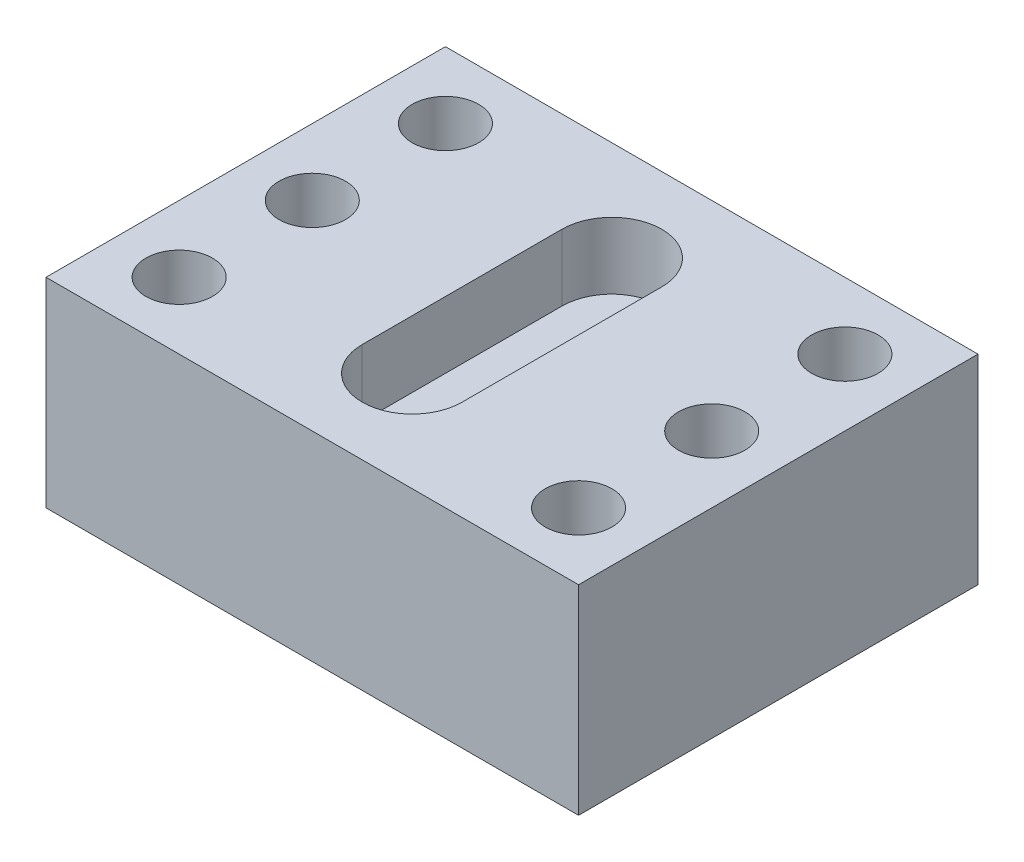
ISO-10303-21;
HEADER;
FILE_DESCRIPTION(('STEP AP214'),'2;1');
FILE_NAME('part.step','',(''),(''),'','','');
FILE_SCHEMA(('AUTOMOTIVE_DESIGN { 1 0 10303 214 1 1 1 1 }'));
ENDSEC;
DATA;
#1=APPLICATION_CONTEXT('core data for automotive mechanical design processes');
#2=APPLICATION_PROTOCOL_DEFINITION('international standard','automotive_design',2000,#1);
#3=PRODUCT_CONTEXT('',#1,'mechanical');
#4=PRODUCT('Part','Part','',(#3));
#5=PRODUCT_RELATED_PRODUCT_CATEGORY('part','',(#4));
#6=PRODUCT_DEFINITION_FORMATION('','',#4);
#7=PRODUCT_DEFINITION_CONTEXT('part definition',#1,'design');
#8=PRODUCT_DEFINITION('design','',#6,#7);
#9=PRODUCT_DEFINITION_SHAPE('','',#8);
#10=(LENGTH_UNIT() NAMED_UNIT(*) SI_UNIT(.MILLI.,.METRE.));
#11=(NAMED_UNIT(*) PLANE_ANGLE_UNIT() SI_UNIT($,.RADIAN.));
#12=(NAMED_UNIT(*) SI_UNIT($,.STERADIAN.) SOLID_ANGLE_UNIT());
#13=UNCERTAINTY_MEASURE_WITH_UNIT(LENGTH_MEASURE(1.E-05),#10,'distance_accuracy_value','');
#14=(GEOMETRIC_REPRESENTATION_CONTEXT(3) GLOBAL_UNCERTAINTY_ASSIGNED_CONTEXT((#13)) GLOBAL_UNIT_ASSIGNED_CONTEXT((#10,
#11,#12)) REPRESENTATION_CONTEXT('',''));
#15=CARTESIAN_POINT('',(0.,0.,0.));
#16=DIRECTION('',(0.,0.,1.));
#17=DIRECTION('',(1.,0.,0.));
#18=AXIS2_PLACEMENT_3D('',#15,#16,#17);
#19=CARTESIAN_POINT('',(101.6,76.2,76.2));
#20=DIRECTION('',(-1.,0.,0.));
#21=DIRECTION('',(0.,0.,1.));
#22=AXIS2_PLACEMENT_3D('',#19,#20,#21);
#23=PLANE('',#22);
#24=DIRECTION('',(0.,0.,-1.));
#25=VECTOR('',#24,1.);
#26=CARTESIAN_POINT('',(101.6,0.,76.2));
#27=LINE('',#26,#25);
#28=CARTESIAN_POINT('',(101.6,0.,76.2));
#29=VERTEX_POINT('',#28);
#30=CARTESIAN_POINT('',(101.6,0.,-76.2));
#31=VERTEX_POINT('',#30);
#32=EDGE_CURVE('E227',#29,#31,#27,.T.);
#33=ORIENTED_EDGE('',*,*,#32,.T.);
#34=DIRECTION('',(0.,-1.,0.));
#35=VECTOR('',#34,1.);
#36=CARTESIAN_POINT('',(101.6,76.2,-76.2));
#37=LINE('',#36,#35);
#38=CARTESIAN_POINT('',(101.6,76.2,-76.2));
#39=VERTEX_POINT('',#38);
#40=EDGE_CURVE('E12',#39,#31,#37,.T.);
#41=ORIENTED_EDGE('',*,*,#40,.F.);
#42=DIRECTION('',(0.,0.,-1.));
#43=VECTOR('',#42,1.);
#44=CARTESIAN_POINT('',(101.6,76.2,76.2));
#45=LINE('',#44,#43);
#46=CARTESIAN_POINT('',(101.6,76.2,76.2));
#47=VERTEX_POINT('',#46);
#48=EDGE_CURVE('E235',#47,#39,#45,.T.);
#49=ORIENTED_EDGE('',*,*,#48,.F.);
#50=DIRECTION('',(0.,-1.,0.));
#51=VECTOR('',#50,1.);
#52=CARTESIAN_POINT('',(101.6,76.2,76.2));
#53=LINE('',#52,#51);
#54=EDGE_CURVE('E255',#47,#29,#53,.T.);
#55=ORIENTED_EDGE('',*,*,#54,.T.);
#56=EDGE_LOOP('',(#33,#41,#49,#55));
#57=FACE_BOUND('',#56,.T.);
#58=ADVANCED_FACE('F48',(#57),#23,.F.);
#59=CARTESIAN_POINT('',(-101.6,76.2,-76.2));
#60=DIRECTION('',(0.,0.,1.));
#61=DIRECTION('',(1.,0.,0.));
#62=AXIS2_PLACEMENT_3D('',#59,#60,#61);
#63=PLANE('',#62);
#64=DIRECTION('',(-1.,0.,0.));
#65=VECTOR('',#64,1.);
#66=CARTESIAN_POINT('',(-101.6,0.,-76.2));
#67=LINE('',#66,#65);
#68=CARTESIAN_POINT('',(-101.6,0.,-76.2));
#69=VERTEX_POINT('',#68);
#70=EDGE_CURVE('E259',#31,#69,#67,.T.);
#71=ORIENTED_EDGE('',*,*,#70,.T.);
#72=DIRECTION('',(0.,-1.,0.));
#73=VECTOR('',#72,1.);
#74=CARTESIAN_POINT('',(-101.6,76.2,-76.2));
#75=LINE('',#74,#73);
#76=CARTESIAN_POINT('',(-101.6,76.2,-76.2));
#77=VERTEX_POINT('',#76);
#78=EDGE_CURVE('E56',#77,#69,#75,.T.);
#79=ORIENTED_EDGE('',*,*,#78,.F.);
#80=DIRECTION('',(-1.,0.,0.));
#81=VECTOR('',#80,1.);
#82=CARTESIAN_POINT('',(-101.6,76.2,-76.2));
#83=LINE('',#82,#81);
#84=EDGE_CURVE('E101',#39,#77,#83,.T.);
#85=ORIENTED_EDGE('',*,*,#84,.F.);
#86=ORIENTED_EDGE('',*,*,#40,.T.);
#87=EDGE_LOOP('',(#71,#79,#85,#86));
#88=FACE_BOUND('',#87,.T.);
#89=ADVANCED_FACE('F344',(#88),#63,.F.);
#90=CARTESIAN_POINT('',(-101.6,76.2,76.2));
#91=DIRECTION('',(1.,0.,0.));
#92=DIRECTION('',(0.,0.,-1.));
#93=AXIS2_PLACEMENT_3D('',#90,#91,#92);
#94=PLANE('',#93);
#95=DIRECTION('',(0.,0.,1.));
#96=VECTOR('',#95,1.);
#97=CARTESIAN_POINT('',(-101.6,0.,76.2));
#98=LINE('',#97,#96);
#99=CARTESIAN_POINT('',(-101.6,0.,76.2));
#100=VERTEX_POINT('',#99);
#101=EDGE_CURVE('E309',#69,#100,#98,.T.);
#102=ORIENTED_EDGE('',*,*,#101,.T.);
#103=DIRECTION('',(0.,-1.,0.));
#104=VECTOR('',#103,1.);
#105=CARTESIAN_POINT('',(-101.6,76.2,76.2));
#106=LINE('',#105,#104);
#107=CARTESIAN_POINT('',(-101.6,76.2,76.2));
#108=VERTEX_POINT('',#107);
#109=EDGE_CURVE('E318',#108,#100,#106,.T.);
#110=ORIENTED_EDGE('',*,*,#109,.F.);
#111=DIRECTION('',(0.,0.,1.));
#112=VECTOR('',#111,1.);
#113=CARTESIAN_POINT('',(-101.6,76.2,76.2));
#114=LINE('',#113,#112);
#115=EDGE_CURVE('E249',#77,#108,#114,.T.);
#116=ORIENTED_EDGE('',*,*,#115,.F.);
#117=ORIENTED_EDGE('',*,*,#78,.T.);
#118=EDGE_LOOP('',(#102,#110,#116,#117));
#119=FACE_BOUND('',#118,.T.);
#120=ADVANCED_FACE('F325',(#119),#94,.F.);
#121=CARTESIAN_POINT('',(-101.6,76.2,76.2));
#122=DIRECTION('',(0.,0.,-1.));
#123=DIRECTION('',(-1.,0.,0.));
#124=AXIS2_PLACEMENT_3D('',#121,#122,#123);
#125=PLANE('',#124);
#126=DIRECTION('',(1.,0.,0.));
#127=VECTOR('',#126,1.);
#128=CARTESIAN_POINT('',(-101.6,0.,76.2));
#129=LINE('',#128,#127);
#130=EDGE_CURVE('E94',#100,#29,#129,.T.);
#131=ORIENTED_EDGE('',*,*,#130,.T.);
#132=ORIENTED_EDGE('',*,*,#54,.F.);
#133=DIRECTION('',(1.,0.,0.));
#134=VECTOR('',#133,1.);
#135=CARTESIAN_POINT('',(-101.6,76.2,76.2));
#136=LINE('',#135,#134);
#137=EDGE_CURVE('E72',#108,#47,#136,.T.);
#138=ORIENTED_EDGE('',*,*,#137,.F.);
#139=ORIENTED_EDGE('',*,*,#109,.T.);
#140=EDGE_LOOP('',(#131,#132,#138,#139));
#141=FACE_BOUND('',#140,.T.);
#142=ADVANCED_FACE('F334',(#141),#125,.F.);
#143=CARTESIAN_POINT('',(0.,76.2,0.));
#144=DIRECTION('',(0.,-1.,0.));
#145=DIRECTION('',(0.,0.,-1.));
#146=AXIS2_PLACEMENT_3D('',#143,#144,#145);
#147=PLANE('',#146);
#148=CARTESIAN_POINT('',(-76.2,76.2,0.));
#149=DIRECTION('',(0.,1.,0.));
#150=DIRECTION('',(0.,0.,1.));
#151=AXIS2_PLACEMENT_3D('',#148,#149,#150);
#152=CIRCLE('',#151,12.7);
#153=CARTESIAN_POINT('',(-76.2,76.2,12.7));
#154=VERTEX_POINT('',#153);
#155=EDGE_CURVE('E210',#154,#154,#152,.T.);
#156=ORIENTED_EDGE('',*,*,#155,.F.);
#157=EDGE_LOOP('',(#156));
#158=FACE_BOUND('',#157,.T.);
#159=CARTESIAN_POINT('',(-76.2,76.2,-50.8));
#160=DIRECTION('',(0.,1.,0.));
#161=DIRECTION('',(0.,0.,1.));
#162=AXIS2_PLACEMENT_3D('',#159,#160,#161);
#163=CIRCLE('',#162,12.7);
#164=CARTESIAN_POINT('',(-76.2,76.2,-38.1));
#165=VERTEX_POINT('',#164);
#166=EDGE_CURVE('E620',#165,#165,#163,.T.);
#167=ORIENTED_EDGE('',*,*,#166,.F.);
#168=EDGE_LOOP('',(#167));
#169=FACE_BOUND('',#168,.T.);
#170=CARTESIAN_POINT('',(76.2,76.2,-50.8));
#171=DIRECTION('',(0.,1.,0.));
#172=DIRECTION('',(0.,0.,-1.));
#173=AXIS2_PLACEMENT_3D('',#170,#171,#172);
#174=CIRCLE('',#173,12.7);
#175=CARTESIAN_POINT('',(76.2,76.2,-63.5));
#176=VERTEX_POINT('',#175);
#177=EDGE_CURVE('E632',#176,#176,#174,.T.);
#178=ORIENTED_EDGE('',*,*,#177,.F.);
#179=EDGE_LOOP('',(#178));
#180=FACE_BOUND('',#179,.T.);
#181=CARTESIAN_POINT('',(76.2,76.2,50.7999999999999));
#182=DIRECTION('',(0.,1.,0.));
#183=DIRECTION('',(0.,0.,-1.));
#184=AXIS2_PLACEMENT_3D('',#181,#182,#183);
#185=CIRCLE('',#184,12.7);
#186=CARTESIAN_POINT('',(76.2,76.2,38.0999999999999));
#187=VERTEX_POINT('',#186);
#188=EDGE_CURVE('E228',#187,#187,#185,.T.);
#189=ORIENTED_EDGE('',*,*,#188,.F.);
#190=EDGE_LOOP('',(#189));
#191=FACE_BOUND('',#190,.T.);
#192=CARTESIAN_POINT('',(76.2,76.2,0.));
#193=DIRECTION('',(0.,1.,0.));
#194=DIRECTION('',(0.,0.,-1.));
#195=AXIS2_PLACEMENT_3D('',#192,#193,#194);
#196=CIRCLE('',#195,12.7);
#197=CARTESIAN_POINT('',(76.2,76.2,-12.7));
#198=VERTEX_POINT('',#197);
#199=EDGE_CURVE('E155',#198,#198,#196,.T.);
#200=ORIENTED_EDGE('',*,*,#199,.F.);
#201=EDGE_LOOP('',(#200));
#202=FACE_BOUND('',#201,.T.);
#203=DIRECTION('',(0.,0.,-1.));
#204=VECTOR('',#203,1.);
#205=CARTESIAN_POINT('',(19.05,76.2,38.1));
#206=LINE('',#205,#204);
#207=CARTESIAN_POINT('',(19.05,76.2,38.1));
#208=VERTEX_POINT('',#207);
#209=CARTESIAN_POINT('',(19.0500000000001,76.2,-38.1));
#210=VERTEX_POINT('',#209);
#211=EDGE_CURVE('E176',#208,#210,#206,.T.);
#212=ORIENTED_EDGE('',*,*,#211,.F.);
#213=CARTESIAN_POINT('',(0.,76.2,38.1));
#214=DIRECTION('',(0.,1.,0.));
#215=DIRECTION('',(0.,0.,1.));
#216=AXIS2_PLACEMENT_3D('',#213,#214,#215);
#217=CIRCLE('',#216,19.05);
#218=CARTESIAN_POINT('',(-19.05,76.2,38.1));
#219=VERTEX_POINT('',#218);
#220=EDGE_CURVE('E63',#219,#208,#217,.T.);
#221=ORIENTED_EDGE('',*,*,#220,.F.);
#222=DIRECTION('',(0.,0.,1.));
#223=VECTOR('',#222,1.);
#224=CARTESIAN_POINT('',(-19.05,76.2,38.1));
#225=LINE('',#224,#223);
#226=CARTESIAN_POINT('',(-19.05,76.2,-38.1));
#227=VERTEX_POINT('',#226);
#228=EDGE_CURVE('E147',#227,#219,#225,.T.);
#229=ORIENTED_EDGE('',*,*,#228,.F.);
#230=CARTESIAN_POINT('',(0.,76.2,-38.1));
#231=DIRECTION('',(0.,1.,0.));
#232=DIRECTION('',(0.,0.,-1.));
#233=AXIS2_PLACEMENT_3D('',#230,#231,#232);
#234=CIRCLE('',#233,19.05);
#235=EDGE_CURVE('E151',#210,#227,#234,.T.);
#236=ORIENTED_EDGE('',*,*,#235,.F.);
#237=EDGE_LOOP('',(#212,#221,#229,#236));
#238=FACE_BOUND('',#237,.T.);
#239=CARTESIAN_POINT('',(-76.2,76.2,50.8));
#240=DIRECTION('',(0.,1.,0.));
#241=DIRECTION('',(0.,0.,1.));
#242=AXIS2_PLACEMENT_3D('',#239,#240,#241);
#243=CIRCLE('',#242,12.7);
#244=CARTESIAN_POINT('',(-76.2,76.2,63.5));
#245=VERTEX_POINT('',#244);
#246=EDGE_CURVE('E209',#245,#245,#243,.T.);
#247=ORIENTED_EDGE('',*,*,#246,.F.);
#248=EDGE_LOOP('',(#247));
#249=FACE_BOUND('',#248,.T.);
#250=ORIENTED_EDGE('',*,*,#48,.T.);
#251=ORIENTED_EDGE('',*,*,#84,.T.);
#252=ORIENTED_EDGE('',*,*,#115,.T.);
#253=ORIENTED_EDGE('',*,*,#137,.T.);
#254=EDGE_LOOP('',(#250,#251,#252,#253));
#255=FACE_BOUND('',#254,.T.);
#256=ADVANCED_FACE('F336',(#158,#169,#180,#191,#202,#238,#249,#255),#147,.F.);
#257=CARTESIAN_POINT('',(0.,0.,0.));
#258=DIRECTION('',(0.,-1.,0.));
#259=DIRECTION('',(0.,0.,-1.));
#260=AXIS2_PLACEMENT_3D('',#257,#258,#259);
#261=PLANE('',#260);
#262=ORIENTED_EDGE('',*,*,#32,.F.);
#263=ORIENTED_EDGE('',*,*,#130,.F.);
#264=ORIENTED_EDGE('',*,*,#101,.F.);
#265=ORIENTED_EDGE('',*,*,#70,.F.);
#266=EDGE_LOOP('',(#262,#263,#264,#265));
#267=FACE_BOUND('',#266,.T.);
#268=ADVANCED_FACE('F330',(#267),#261,.T.);
#269=CARTESIAN_POINT('',(-76.2,50.8,50.8));
#270=DIRECTION('',(0.,1.,0.));
#271=DIRECTION('',(0.,0.,1.));
#272=AXIS2_PLACEMENT_3D('',#269,#270,#271);
#273=CYLINDRICAL_SURFACE('',#272,12.7);
#274=CARTESIAN_POINT('',(-76.2,50.8,50.8));
#275=DIRECTION('',(0.,1.,0.));
#276=DIRECTION('',(0.,0.,1.));
#277=AXIS2_PLACEMENT_3D('',#274,#275,#276);
#278=CIRCLE('',#277,12.7);
#279=CARTESIAN_POINT('',(-76.2,50.8,63.5));
#280=VERTEX_POINT('',#279);
#281=EDGE_CURVE('E222',#280,#280,#278,.T.);
#282=ORIENTED_EDGE('',*,*,#281,.F.);
#283=EDGE_LOOP('',(#282));
#284=FACE_BOUND('',#283,.T.);
#285=ORIENTED_EDGE('',*,*,#246,.T.);
#286=EDGE_LOOP('',(#285));
#287=FACE_BOUND('',#286,.T.);
#288=ADVANCED_FACE('F377',(#284,#287),#273,.F.);
#289=CARTESIAN_POINT('',(-76.2,50.8,50.8));
#290=DIRECTION('',(0.,1.,0.));
#291=DIRECTION('',(0.,0.,1.));
#292=AXIS2_PLACEMENT_3D('',#289,#290,#291);
#293=PLANE('',#292);
#294=ORIENTED_EDGE('',*,*,#281,.T.);
#295=EDGE_LOOP('',(#294));
#296=FACE_BOUND('',#295,.T.);
#297=ADVANCED_FACE('F384',(#296),#293,.T.);
#298=CARTESIAN_POINT('',(0.,50.8,38.1));
#299=DIRECTION('',(0.,1.,0.));
#300=DIRECTION('',(0.,0.,1.));
#301=AXIS2_PLACEMENT_3D('',#298,#299,#300);
#302=CYLINDRICAL_SURFACE('',#301,19.05);
#303=ORIENTED_EDGE('',*,*,#220,.T.);
#304=DIRECTION('',(0.,1.,0.));
#305=VECTOR('',#304,1.);
#306=CARTESIAN_POINT('',(19.05,50.8,38.1));
#307=LINE('',#306,#305);
#308=CARTESIAN_POINT('',(19.05,50.8,38.1));
#309=VERTEX_POINT('',#308);
#310=EDGE_CURVE('E121',#309,#208,#307,.T.);
#311=ORIENTED_EDGE('',*,*,#310,.F.);
#312=CARTESIAN_POINT('',(0.,50.8,38.1));
#313=DIRECTION('',(0.,1.,0.));
#314=DIRECTION('',(0.,0.,1.));
#315=AXIS2_PLACEMENT_3D('',#312,#313,#314);
#316=CIRCLE('',#315,19.05);
#317=CARTESIAN_POINT('',(-19.05,50.8,38.1));
#318=VERTEX_POINT('',#317);
#319=EDGE_CURVE('E125',#318,#309,#316,.T.);
#320=ORIENTED_EDGE('',*,*,#319,.F.);
#321=DIRECTION('',(0.,1.,0.));
#322=VECTOR('',#321,1.);
#323=CARTESIAN_POINT('',(-19.05,50.8,38.1));
#324=LINE('',#323,#322);
#325=EDGE_CURVE('E189',#318,#219,#324,.T.);
#326=ORIENTED_EDGE('',*,*,#325,.T.);
#327=EDGE_LOOP('',(#303,#311,#320,#326));
#328=FACE_BOUND('',#327,.T.);
#329=ADVANCED_FACE('F123',(#328),#302,.F.);
#330=CARTESIAN_POINT('',(-19.05,50.8,38.1));
#331=DIRECTION('',(-1.,0.,0.));
#332=DIRECTION('',(0.,0.,1.));
#333=AXIS2_PLACEMENT_3D('',#330,#331,#332);
#334=PLANE('',#333);
#335=ORIENTED_EDGE('',*,*,#228,.T.);
#336=ORIENTED_EDGE('',*,*,#325,.F.);
#337=DIRECTION('',(0.,0.,1.));
#338=VECTOR('',#337,1.);
#339=CARTESIAN_POINT('',(-19.05,50.8,38.1));
#340=LINE('',#339,#338);
#341=CARTESIAN_POINT('',(-19.05,50.8,-38.1));
#342=VERTEX_POINT('',#341);
#343=EDGE_CURVE('E132',#342,#318,#340,.T.);
#344=ORIENTED_EDGE('',*,*,#343,.F.);
#345=DIRECTION('',(0.,1.,0.));
#346=VECTOR('',#345,1.);
#347=CARTESIAN_POINT('',(-19.05,50.8,-38.1));
#348=LINE('',#347,#346);
#349=EDGE_CURVE('E193',#342,#227,#348,.T.);
#350=ORIENTED_EDGE('',*,*,#349,.T.);
#351=EDGE_LOOP('',(#335,#336,#344,#350));
#352=FACE_BOUND('',#351,.T.);
#353=ADVANCED_FACE('F403',(#352),#334,.F.);
#354=CARTESIAN_POINT('',(0.,50.8,-38.1));
#355=DIRECTION('',(0.,1.,0.));
#356=DIRECTION('',(0.,0.,1.));
#357=AXIS2_PLACEMENT_3D('',#354,#355,#356);
#358=CYLINDRICAL_SURFACE('',#357,19.05);
#359=ORIENTED_EDGE('',*,*,#235,.T.);
#360=ORIENTED_EDGE('',*,*,#349,.F.);
#361=CARTESIAN_POINT('',(0.,50.8,-38.1));
#362=DIRECTION('',(0.,1.,0.));
#363=DIRECTION('',(0.,0.,-1.));
#364=AXIS2_PLACEMENT_3D('',#361,#362,#363);
#365=CIRCLE('',#364,19.05);
#366=CARTESIAN_POINT('',(19.0500000000001,50.8,-38.1));
#367=VERTEX_POINT('',#366);
#368=EDGE_CURVE('E141',#367,#342,#365,.T.);
#369=ORIENTED_EDGE('',*,*,#368,.F.);
#370=DIRECTION('',(0.,1.,0.));
#371=VECTOR('',#370,1.);
#372=CARTESIAN_POINT('',(19.0500000000001,50.8,-38.1));
#373=LINE('',#372,#371);
#374=EDGE_CURVE('E131',#367,#210,#373,.T.);
#375=ORIENTED_EDGE('',*,*,#374,.T.);
#376=EDGE_LOOP('',(#359,#360,#369,#375));
#377=FACE_BOUND('',#376,.T.);
#378=ADVANCED_FACE('F413',(#377),#358,.F.);
#379=CARTESIAN_POINT('',(19.05,50.8,38.1));
#380=DIRECTION('',(1.,0.,0.));
#381=DIRECTION('',(0.,0.,-1.));
#382=AXIS2_PLACEMENT_3D('',#379,#380,#381);
#383=PLANE('',#382);
#384=ORIENTED_EDGE('',*,*,#211,.T.);
#385=ORIENTED_EDGE('',*,*,#374,.F.);
#386=DIRECTION('',(0.,0.,-1.));
#387=VECTOR('',#386,1.);
#388=CARTESIAN_POINT('',(19.05,50.8,38.1));
#389=LINE('',#388,#387);
#390=EDGE_CURVE('E135',#309,#367,#389,.T.);
#391=ORIENTED_EDGE('',*,*,#390,.F.);
#392=ORIENTED_EDGE('',*,*,#310,.T.);
#393=EDGE_LOOP('',(#384,#385,#391,#392));
#394=FACE_BOUND('',#393,.T.);
#395=ADVANCED_FACE('F136',(#394),#383,.F.);
#396=CARTESIAN_POINT('',(0.,50.8,38.1));
#397=DIRECTION('',(0.,1.,0.));
#398=DIRECTION('',(0.,0.,1.));
#399=AXIS2_PLACEMENT_3D('',#396,#397,#398);
#400=PLANE('',#399);
#401=ORIENTED_EDGE('',*,*,#319,.T.);
#402=ORIENTED_EDGE('',*,*,#390,.T.);
#403=ORIENTED_EDGE('',*,*,#368,.T.);
#404=ORIENTED_EDGE('',*,*,#343,.T.);
#405=EDGE_LOOP('',(#401,#402,#403,#404));
#406=FACE_BOUND('',#405,.T.);
#407=ADVANCED_FACE('F144',(#406),#400,.T.);
#408=CARTESIAN_POINT('',(76.2,50.8,0.));
#409=DIRECTION('',(0.,1.,0.));
#410=DIRECTION('',(0.,0.,1.));
#411=AXIS2_PLACEMENT_3D('',#408,#409,#410);
#412=CYLINDRICAL_SURFACE('',#411,12.7);
#413=CARTESIAN_POINT('',(76.2,50.8,0.));
#414=DIRECTION('',(0.,1.,0.));
#415=DIRECTION('',(0.,0.,-1.));
#416=AXIS2_PLACEMENT_3D('',#413,#414,#415);
#417=CIRCLE('',#416,12.7);
#418=CARTESIAN_POINT('',(76.2,50.8,-12.7));
#419=VERTEX_POINT('',#418);
#420=EDGE_CURVE('E637',#419,#419,#417,.T.);
#421=ORIENTED_EDGE('',*,*,#420,.F.);
#422=EDGE_LOOP('',(#421));
#423=FACE_BOUND('',#422,.T.);
#424=ORIENTED_EDGE('',*,*,#199,.T.);
#425=EDGE_LOOP('',(#424));
#426=FACE_BOUND('',#425,.T.);
#427=ADVANCED_FACE('F438',(#423,#426),#412,.F.);
#428=CARTESIAN_POINT('',(76.2,50.8,0.));
#429=DIRECTION('',(0.,-1.,0.));
#430=DIRECTION('',(0.,0.,-1.));
#431=AXIS2_PLACEMENT_3D('',#428,#429,#430);
#432=PLANE('',#431);
#433=ORIENTED_EDGE('',*,*,#420,.T.);
#434=EDGE_LOOP('',(#433));
#435=FACE_BOUND('',#434,.T.);
#436=ADVANCED_FACE('F448',(#435),#432,.F.);
#437=CARTESIAN_POINT('',(76.2,50.8,50.7999999999999));
#438=DIRECTION('',(0.,1.,0.));
#439=DIRECTION('',(0.,0.,1.));
#440=AXIS2_PLACEMENT_3D('',#437,#438,#439);
#441=CYLINDRICAL_SURFACE('',#440,12.7);
#442=CARTESIAN_POINT('',(76.2,50.8,50.7999999999999));
#443=DIRECTION('',(0.,1.,0.));
#444=DIRECTION('',(0.,0.,-1.));
#445=AXIS2_PLACEMENT_3D('',#442,#443,#444);
#446=CIRCLE('',#445,12.7);
#447=CARTESIAN_POINT('',(76.2,50.8,38.0999999999999));
#448=VERTEX_POINT('',#447);
#449=EDGE_CURVE('E645',#448,#448,#446,.T.);
#450=ORIENTED_EDGE('',*,*,#449,.F.);
#451=EDGE_LOOP('',(#450));
#452=FACE_BOUND('',#451,.T.);
#453=ORIENTED_EDGE('',*,*,#188,.T.);
#454=EDGE_LOOP('',(#453));
#455=FACE_BOUND('',#454,.T.);
#456=ADVANCED_FACE('F458',(#452,#455),#441,.F.);
#457=CARTESIAN_POINT('',(76.2,50.8,50.7999999999999));
#458=DIRECTION('',(0.,-1.,0.));
#459=DIRECTION('',(0.,0.,-1.));
#460=AXIS2_PLACEMENT_3D('',#457,#458,#459);
#461=PLANE('',#460);
#462=ORIENTED_EDGE('',*,*,#449,.T.);
#463=EDGE_LOOP('',(#462));
#464=FACE_BOUND('',#463,.T.);
#465=ADVANCED_FACE('F468',(#464),#461,.F.);
#466=CARTESIAN_POINT('',(76.2,50.8,-50.8));
#467=DIRECTION('',(0.,1.,0.));
#468=DIRECTION('',(0.,0.,1.));
#469=AXIS2_PLACEMENT_3D('',#466,#467,#468);
#470=CYLINDRICAL_SURFACE('',#469,12.7);
#471=CARTESIAN_POINT('',(76.2,50.8,-50.8));
#472=DIRECTION('',(0.,1.,0.));
#473=DIRECTION('',(0.,0.,-1.));
#474=AXIS2_PLACEMENT_3D('',#471,#472,#473);
#475=CIRCLE('',#474,12.7);
#476=CARTESIAN_POINT('',(76.2,50.8,-63.5));
#477=VERTEX_POINT('',#476);
#478=EDGE_CURVE('E624',#477,#477,#475,.T.);
#479=ORIENTED_EDGE('',*,*,#478,.F.);
#480=EDGE_LOOP('',(#479));
#481=FACE_BOUND('',#480,.T.);
#482=ORIENTED_EDGE('',*,*,#177,.T.);
#483=EDGE_LOOP('',(#482));
#484=FACE_BOUND('',#483,.T.);
#485=ADVANCED_FACE('F478',(#481,#484),#470,.F.);
#486=CARTESIAN_POINT('',(76.2,50.8,-50.8));
#487=DIRECTION('',(0.,-1.,0.));
#488=DIRECTION('',(0.,0.,-1.));
#489=AXIS2_PLACEMENT_3D('',#486,#487,#488);
#490=PLANE('',#489);
#491=ORIENTED_EDGE('',*,*,#478,.T.);
#492=EDGE_LOOP('',(#491));
#493=FACE_BOUND('',#492,.T.);
#494=ADVANCED_FACE('F488',(#493),#490,.F.);
#495=CARTESIAN_POINT('',(-76.2,50.8,-50.8));
#496=DIRECTION('',(0.,1.,0.));
#497=DIRECTION('',(0.,0.,1.));
#498=AXIS2_PLACEMENT_3D('',#495,#496,#497);
#499=CYLINDRICAL_SURFACE('',#498,12.7);
#500=CARTESIAN_POINT('',(-76.2,50.8,-50.8));
#501=DIRECTION('',(0.,1.,0.));
#502=DIRECTION('',(0.,0.,1.));
#503=AXIS2_PLACEMENT_3D('',#500,#501,#502);
#504=CIRCLE('',#503,12.7);
#505=CARTESIAN_POINT('',(-76.2,50.8,-38.1));
#506=VERTEX_POINT('',#505);
#507=EDGE_CURVE('E617',#506,#506,#504,.T.);
#508=ORIENTED_EDGE('',*,*,#507,.F.);
#509=EDGE_LOOP('',(#508));
#510=FACE_BOUND('',#509,.T.);
#511=ORIENTED_EDGE('',*,*,#166,.T.);
#512=EDGE_LOOP('',(#511));
#513=FACE_BOUND('',#512,.T.);
#514=ADVANCED_FACE('F498',(#510,#513),#499,.F.);
#515=CARTESIAN_POINT('',(-76.2,50.8,-50.8));
#516=DIRECTION('',(0.,1.,0.));
#517=DIRECTION('',(0.,0.,1.));
#518=AXIS2_PLACEMENT_3D('',#515,#516,#517);
#519=PLANE('',#518);
#520=ORIENTED_EDGE('',*,*,#507,.T.);
#521=EDGE_LOOP('',(#520));
#522=FACE_BOUND('',#521,.T.);
#523=ADVANCED_FACE('F508',(#522),#519,.T.);
#524=CARTESIAN_POINT('',(-76.2,50.8,0.));
#525=DIRECTION('',(0.,1.,0.));
#526=DIRECTION('',(0.,0.,1.));
#527=AXIS2_PLACEMENT_3D('',#524,#525,#526);
#528=CYLINDRICAL_SURFACE('',#527,12.7);
#529=CARTESIAN_POINT('',(-76.2,50.8,0.));
#530=DIRECTION('',(0.,1.,0.));
#531=DIRECTION('',(0.,0.,1.));
#532=AXIS2_PLACEMENT_3D('',#529,#530,#531);
#533=CIRCLE('',#532,12.7);
#534=CARTESIAN_POINT('',(-76.2,50.8,12.7));
#535=VERTEX_POINT('',#534);
#536=EDGE_CURVE('E204',#535,#535,#533,.T.);
#537=ORIENTED_EDGE('',*,*,#536,.F.);
#538=EDGE_LOOP('',(#537));
#539=FACE_BOUND('',#538,.T.);
#540=ORIENTED_EDGE('',*,*,#155,.T.);
#541=EDGE_LOOP('',(#540));
#542=FACE_BOUND('',#541,.T.);
#543=ADVANCED_FACE('F518',(#539,#542),#528,.F.);
#544=CARTESIAN_POINT('',(-76.2,50.8,0.));
#545=DIRECTION('',(0.,1.,0.));
#546=DIRECTION('',(0.,0.,1.));
#547=AXIS2_PLACEMENT_3D('',#544,#545,#546);
#548=PLANE('',#547);
#549=ORIENTED_EDGE('',*,*,#536,.T.);
#550=EDGE_LOOP('',(#549));
#551=FACE_BOUND('',#550,.T.);
#552=ADVANCED_FACE('F527',(#551),#548,.T.);
#553=CLOSED_SHELL('',(#58,#89,#120,#142,#256,#268,#288,#297,#329,#353,#378,#395,#407,#427,#436,
#456,#465,#485,#494,#514,#523,#543,#552));
#554=MANIFOLD_SOLID_BREP('B2',#553);
#555=ADVANCED_BREP_SHAPE_REPRESENTATION('',(#18,#554),#14);
#556=SHAPE_DEFINITION_REPRESENTATION(#9,#555);
ENDSEC;
END-ISO-10303-21;
